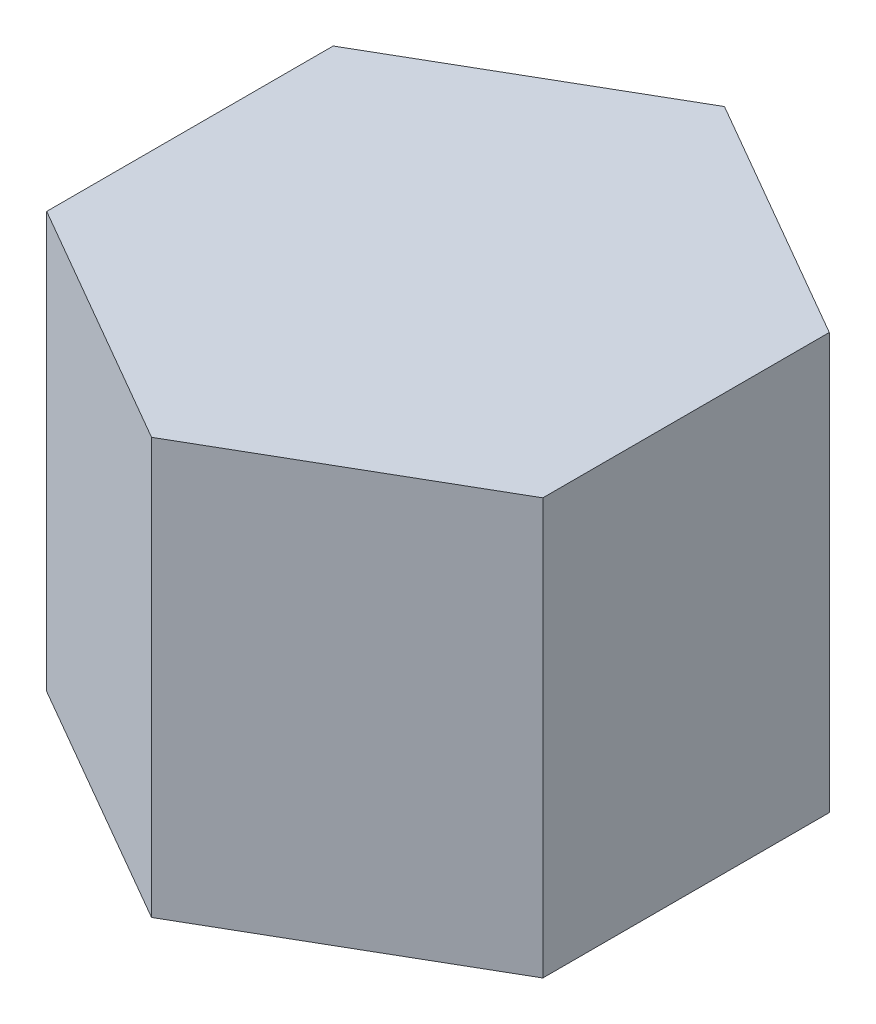
ISO-10303-21;
HEADER;
FILE_DESCRIPTION(('STEP AP214'),'2;1');
FILE_NAME('part.step','',(''),(''),'','','');
FILE_SCHEMA(('AUTOMOTIVE_DESIGN { 1 0 10303 214 1 1 1 1 }'));
ENDSEC;
DATA;
#1=APPLICATION_CONTEXT('core data for automotive mechanical design processes');
#2=APPLICATION_PROTOCOL_DEFINITION('international standard','automotive_design',2000,#1);
#3=PRODUCT_CONTEXT('',#1,'mechanical');
#4=PRODUCT('Part','Part','',(#3));
#5=PRODUCT_RELATED_PRODUCT_CATEGORY('part','',(#4));
#6=PRODUCT_DEFINITION_FORMATION('','',#4);
#7=PRODUCT_DEFINITION_CONTEXT('part definition',#1,'design');
#8=PRODUCT_DEFINITION('design','',#6,#7);
#9=PRODUCT_DEFINITION_SHAPE('','',#8);
#10=(LENGTH_UNIT() NAMED_UNIT(*) SI_UNIT(.MILLI.,.METRE.));
#11=(NAMED_UNIT(*) PLANE_ANGLE_UNIT() SI_UNIT($,.RADIAN.));
#12=(NAMED_UNIT(*) SI_UNIT($,.STERADIAN.) SOLID_ANGLE_UNIT());
#13=UNCERTAINTY_MEASURE_WITH_UNIT(LENGTH_MEASURE(1.E-05),#10,'distance_accuracy_value','');
#14=(GEOMETRIC_REPRESENTATION_CONTEXT(3) GLOBAL_UNCERTAINTY_ASSIGNED_CONTEXT((#13)) GLOBAL_UNIT_ASSIGNED_CONTEXT((#10,
#11,#12)) REPRESENTATION_CONTEXT('',''));
#15=CARTESIAN_POINT('',(0.,0.,0.));
#16=DIRECTION('',(0.,0.,1.));
#17=DIRECTION('',(1.,0.,0.));
#18=AXIS2_PLACEMENT_3D('',#15,#16,#17);
#19=CARTESIAN_POINT('',(203.642660308706,-148.537700895744,289.774920412926));
#20=DIRECTION('',(-0.499999999999943,0.,-0.866025403784472));
#21=DIRECTION('',(-0.866025403784472,0.,0.499999999999943));
#22=AXIS2_PLACEMENT_3D('',#19,#20,#21);
#23=PLANE('',#22);
#24=CARTESIAN_POINT('',(203.339551417382,-149.045793579175,289.949920412926));
#25=DIRECTION('',(0.866025403784471,0.,-0.499999999999943));
#26=VECTOR('',#25,1.);
#27=LINE('',#24,#26);
#28=CARTESIAN_POINT('',(203.339551417382,-149.045793579175,289.949920412926));
#29=VERTEX_POINT('',#28);
#30=CARTESIAN_POINT('',(203.642660308706,-149.045793579175,289.774920412926));
#31=VERTEX_POINT('',#30);
#32=EDGE_CURVE('E170',#29,#31,#27,.T.);
#33=ORIENTED_EDGE('',*,*,#32,.T.);
#34=CARTESIAN_POINT('',(203.642660308706,-148.537700895744,289.774920412926));
#35=DIRECTION('',(0.,-1.,0.));
#36=VECTOR('',#35,1.);
#37=LINE('',#34,#36);
#38=CARTESIAN_POINT('',(203.642660308706,-148.537700895744,289.774920412926));
#39=VERTEX_POINT('',#38);
#40=EDGE_CURVE('E35',#39,#31,#37,.T.);
#41=ORIENTED_EDGE('',*,*,#40,.F.);
#42=CARTESIAN_POINT('',(203.339551417382,-148.537700895744,289.949920412926));
#43=DIRECTION('',(0.866025403784471,0.,-0.499999999999943));
#44=VECTOR('',#43,1.);
#45=LINE('',#42,#44);
#46=CARTESIAN_POINT('',(203.339551417382,-148.537700895744,289.949920412926));
#47=VERTEX_POINT('',#46);
#48=EDGE_CURVE('E159',#47,#39,#45,.T.);
#49=ORIENTED_EDGE('',*,*,#48,.F.);
#50=CARTESIAN_POINT('',(203.339551417382,-148.537700895744,289.949920412926));
#51=DIRECTION('',(0.,-1.,0.));
#52=VECTOR('',#51,1.);
#53=LINE('',#50,#52);
#54=EDGE_CURVE('E10',#47,#29,#53,.T.);
#55=ORIENTED_EDGE('',*,*,#54,.T.);
#56=EDGE_LOOP('',(#33,#41,#49,#55));
#57=FACE_BOUND('',#56,.T.);
#58=ADVANCED_FACE('F16',(#57),#23,.F.);
#59=CARTESIAN_POINT('',(203.339551417382,-148.537700895744,289.949920412926));
#60=DIRECTION('',(0.500000000000062,0.,-0.866025403784403));
#61=DIRECTION('',(-0.866025403784403,0.,-0.500000000000062));
#62=AXIS2_PLACEMENT_3D('',#59,#60,#61);
#63=PLANE('',#62);
#64=CARTESIAN_POINT('',(203.036442526057,-149.045793579175,289.774920412925));
#65=DIRECTION('',(0.866025403784403,0.,0.500000000000062));
#66=VECTOR('',#65,1.);
#67=LINE('',#64,#66);
#68=CARTESIAN_POINT('',(203.036442526057,-149.045793579175,289.774920412925));
#69=VERTEX_POINT('',#68);
#70=EDGE_CURVE('E167',#69,#29,#67,.T.);
#71=ORIENTED_EDGE('',*,*,#70,.T.);
#72=ORIENTED_EDGE('',*,*,#54,.F.);
#73=CARTESIAN_POINT('',(203.036442526057,-148.537700895744,289.774920412925));
#74=DIRECTION('',(0.866025403784403,0.,0.500000000000062));
#75=VECTOR('',#74,1.);
#76=LINE('',#73,#75);
#77=CARTESIAN_POINT('',(203.036442526057,-148.537700895744,289.774920412925));
#78=VERTEX_POINT('',#77);
#79=EDGE_CURVE('E156',#78,#47,#76,.T.);
#80=ORIENTED_EDGE('',*,*,#79,.F.);
#81=CARTESIAN_POINT('',(203.036442526057,-148.537700895744,289.774920412925));
#82=DIRECTION('',(0.,-1.,0.));
#83=VECTOR('',#82,1.);
#84=LINE('',#81,#83);
#85=EDGE_CURVE('E27',#78,#69,#84,.T.);
#86=ORIENTED_EDGE('',*,*,#85,.T.);
#87=EDGE_LOOP('',(#71,#72,#80,#86));
#88=FACE_BOUND('',#87,.T.);
#89=ADVANCED_FACE('F189',(#88),#63,.F.);
#90=CARTESIAN_POINT('',(203.036442526057,-148.537700895744,290.831971220494));
#91=DIRECTION('',(1.,0.,0.));
#92=DIRECTION('',(0.,1.,0.));
#93=AXIS2_PLACEMENT_3D('',#90,#91,#92);
#94=PLANE('',#93);
#95=CARTESIAN_POINT('',(203.036442526057,-149.045793579175,289.424920412926));
#96=DIRECTION('',(0.,0.,1.));
#97=VECTOR('',#96,1.);
#98=LINE('',#95,#97);
#99=CARTESIAN_POINT('',(203.036442526057,-149.045793579175,289.424920412926));
#100=VERTEX_POINT('',#99);
#101=EDGE_CURVE('E163',#100,#69,#98,.T.);
#102=ORIENTED_EDGE('',*,*,#101,.T.);
#103=ORIENTED_EDGE('',*,*,#85,.F.);
#104=CARTESIAN_POINT('',(203.036442526057,-148.537700895744,289.424920412926));
#105=DIRECTION('',(0.,0.,1.));
#106=VECTOR('',#105,1.);
#107=LINE('',#104,#106);
#108=CARTESIAN_POINT('',(203.036442526057,-148.537700895744,289.424920412926));
#109=VERTEX_POINT('',#108);
#110=EDGE_CURVE('E106',#109,#78,#107,.T.);
#111=ORIENTED_EDGE('',*,*,#110,.F.);
#112=CARTESIAN_POINT('',(203.036442526057,-148.537700895744,289.424920412926));
#113=DIRECTION('',(0.,-1.,0.));
#114=VECTOR('',#113,1.);
#115=LINE('',#112,#114);
#116=EDGE_CURVE('E94',#109,#100,#115,.T.);
#117=ORIENTED_EDGE('',*,*,#116,.T.);
#118=EDGE_LOOP('',(#102,#103,#111,#117));
#119=FACE_BOUND('',#118,.T.);
#120=ADVANCED_FACE('F198',(#119),#94,.F.);
#121=CARTESIAN_POINT('',(203.036442526057,-148.537700895744,289.424920412926));
#122=DIRECTION('',(0.499999999999978,0.,0.866025403784452));
#123=DIRECTION('',(0.866025403784452,0.,-0.499999999999978));
#124=AXIS2_PLACEMENT_3D('',#121,#122,#123);
#125=PLANE('',#124);
#126=CARTESIAN_POINT('',(203.339551417382,-149.045793579175,289.249920412926));
#127=DIRECTION('',(-0.866025403784452,0.,0.499999999999978));
#128=VECTOR('',#127,1.);
#129=LINE('',#126,#128);
#130=CARTESIAN_POINT('',(203.339551417382,-149.045793579175,289.249920412926));
#131=VERTEX_POINT('',#130);
#132=EDGE_CURVE('E162',#131,#100,#129,.T.);
#133=ORIENTED_EDGE('',*,*,#132,.T.);
#134=ORIENTED_EDGE('',*,*,#116,.F.);
#135=CARTESIAN_POINT('',(203.339551417382,-148.537700895744,289.249920412926));
#136=DIRECTION('',(-0.866025403784452,0.,0.499999999999978));
#137=VECTOR('',#136,1.);
#138=LINE('',#135,#137);
#139=CARTESIAN_POINT('',(203.339551417382,-148.537700895744,289.249920412926));
#140=VERTEX_POINT('',#139);
#141=EDGE_CURVE('E98',#140,#109,#138,.T.);
#142=ORIENTED_EDGE('',*,*,#141,.F.);
#143=CARTESIAN_POINT('',(203.339551417382,-148.537700895744,289.249920412926));
#144=DIRECTION('',(0.,-1.,0.));
#145=VECTOR('',#144,1.);
#146=LINE('',#143,#145);
#147=EDGE_CURVE('E79',#140,#131,#146,.T.);
#148=ORIENTED_EDGE('',*,*,#147,.T.);
#149=EDGE_LOOP('',(#133,#134,#142,#148));
#150=FACE_BOUND('',#149,.T.);
#151=ADVANCED_FACE('F100',(#150),#125,.F.);
#152=CARTESIAN_POINT('',(203.339551417382,-148.537700895744,289.249920412926));
#153=DIRECTION('',(-0.499999999999978,0.,0.866025403784452));
#154=DIRECTION('',(0.866025403784452,0.,0.499999999999978));
#155=AXIS2_PLACEMENT_3D('',#152,#153,#154);
#156=PLANE('',#155);
#157=CARTESIAN_POINT('',(203.642660308706,-149.045793579175,289.424920412926));
#158=DIRECTION('',(-0.866025403784452,0.,-0.499999999999978));
#159=VECTOR('',#158,1.);
#160=LINE('',#157,#159);
#161=CARTESIAN_POINT('',(203.642660308706,-149.045793579175,289.424920412926));
#162=VERTEX_POINT('',#161);
#163=EDGE_CURVE('E88',#162,#131,#160,.T.);
#164=ORIENTED_EDGE('',*,*,#163,.T.);
#165=ORIENTED_EDGE('',*,*,#147,.F.);
#166=CARTESIAN_POINT('',(203.642660308706,-148.537700895744,289.424920412926));
#167=DIRECTION('',(-0.866025403784452,0.,-0.499999999999978));
#168=VECTOR('',#167,1.);
#169=LINE('',#166,#168);
#170=CARTESIAN_POINT('',(203.642660308706,-148.537700895744,289.424920412926));
#171=VERTEX_POINT('',#170);
#172=EDGE_CURVE('E84',#171,#140,#169,.T.);
#173=ORIENTED_EDGE('',*,*,#172,.F.);
#174=CARTESIAN_POINT('',(203.642660308706,-148.537700895744,289.424920412926));
#175=DIRECTION('',(0.,-1.,0.));
#176=VECTOR('',#175,1.);
#177=LINE('',#174,#176);
#178=EDGE_CURVE('E58',#171,#162,#177,.T.);
#179=ORIENTED_EDGE('',*,*,#178,.T.);
#180=EDGE_LOOP('',(#164,#165,#173,#179));
#181=FACE_BOUND('',#180,.T.);
#182=ADVANCED_FACE('F82',(#181),#156,.F.);
#183=CARTESIAN_POINT('',(203.642660308706,-148.537700895744,290.831971220494));
#184=DIRECTION('',(-1.,0.,0.));
#185=DIRECTION('',(0.,-1.,0.));
#186=AXIS2_PLACEMENT_3D('',#183,#184,#185);
#187=PLANE('',#186);
#188=CARTESIAN_POINT('',(203.642660308706,-149.045793579175,289.774920412926));
#189=DIRECTION('',(0.,0.,-1.));
#190=VECTOR('',#189,1.);
#191=LINE('',#188,#190);
#192=EDGE_CURVE('E160',#31,#162,#191,.T.);
#193=ORIENTED_EDGE('',*,*,#192,.T.);
#194=ORIENTED_EDGE('',*,*,#178,.F.);
#195=CARTESIAN_POINT('',(203.642660308706,-148.537700895744,289.774920412926));
#196=DIRECTION('',(0.,0.,-1.));
#197=VECTOR('',#196,1.);
#198=LINE('',#195,#197);
#199=EDGE_CURVE('E112',#39,#171,#198,.T.);
#200=ORIENTED_EDGE('',*,*,#199,.F.);
#201=ORIENTED_EDGE('',*,*,#40,.T.);
#202=EDGE_LOOP('',(#193,#194,#200,#201));
#203=FACE_BOUND('',#202,.T.);
#204=ADVANCED_FACE('F131',(#203),#187,.F.);
#205=CARTESIAN_POINT('',(206.339551417382,-148.537700895744,290.831971220494));
#206=DIRECTION('',(0.,-1.,0.));
#207=DIRECTION('',(1.,0.,0.));
#208=AXIS2_PLACEMENT_3D('',#205,#206,#207);
#209=PLANE('',#208);
#210=ORIENTED_EDGE('',*,*,#48,.T.);
#211=ORIENTED_EDGE('',*,*,#199,.T.);
#212=ORIENTED_EDGE('',*,*,#172,.T.);
#213=ORIENTED_EDGE('',*,*,#141,.T.);
#214=ORIENTED_EDGE('',*,*,#110,.T.);
#215=ORIENTED_EDGE('',*,*,#79,.T.);
#216=EDGE_LOOP('',(#210,#211,#212,#213,#214,#215));
#217=FACE_BOUND('',#216,.T.);
#218=ADVANCED_FACE('F111',(#217),#209,.F.);
#219=CARTESIAN_POINT('',(206.339551417382,-149.045793579175,290.831971220494));
#220=DIRECTION('',(0.,-1.,0.));
#221=DIRECTION('',(1.,0.,0.));
#222=AXIS2_PLACEMENT_3D('',#219,#220,#221);
#223=PLANE('',#222);
#224=ORIENTED_EDGE('',*,*,#32,.F.);
#225=ORIENTED_EDGE('',*,*,#70,.F.);
#226=ORIENTED_EDGE('',*,*,#101,.F.);
#227=ORIENTED_EDGE('',*,*,#132,.F.);
#228=ORIENTED_EDGE('',*,*,#163,.F.);
#229=ORIENTED_EDGE('',*,*,#192,.F.);
#230=EDGE_LOOP('',(#224,#225,#226,#227,#228,#229));
#231=FACE_BOUND('',#230,.T.);
#232=ADVANCED_FACE('F130',(#231),#223,.T.);
#233=CLOSED_SHELL('',(#58,#89,#120,#151,#182,#204,#218,#232));
#234=MANIFOLD_SOLID_BREP('B1',#233);
#235=ADVANCED_BREP_SHAPE_REPRESENTATION('',(#18,#234),#14);
#236=SHAPE_DEFINITION_REPRESENTATION(#9,#235);
ENDSEC;
END-ISO-10303-21;
